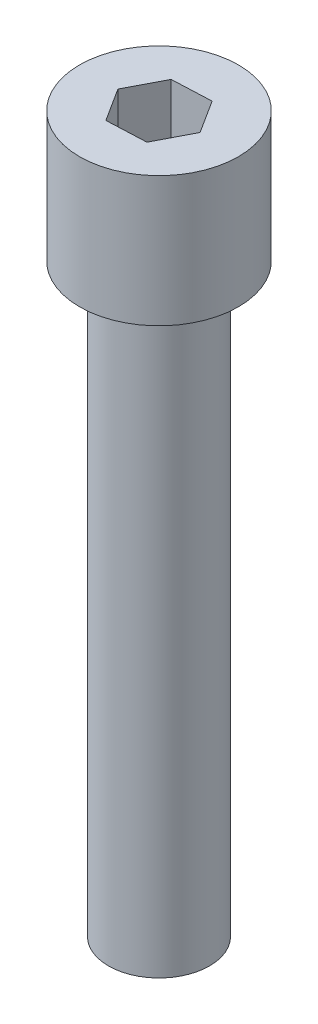
ISO-10303-21;
HEADER;
FILE_DESCRIPTION(('STEP AP214'),'2;1');
FILE_NAME('part.step','',(''),(''),'','','');
FILE_SCHEMA(('AUTOMOTIVE_DESIGN { 1 0 10303 214 1 1 1 1 }'));
ENDSEC;
DATA;
#1=APPLICATION_CONTEXT('core data for automotive mechanical design processes');
#2=APPLICATION_PROTOCOL_DEFINITION('international standard','automotive_design',2000,#1);
#3=PRODUCT_CONTEXT('',#1,'mechanical');
#4=PRODUCT('Part','Part','',(#3));
#5=PRODUCT_RELATED_PRODUCT_CATEGORY('part','',(#4));
#6=PRODUCT_DEFINITION_FORMATION('','',#4);
#7=PRODUCT_DEFINITION_CONTEXT('part definition',#1,'design');
#8=PRODUCT_DEFINITION('design','',#6,#7);
#9=PRODUCT_DEFINITION_SHAPE('','',#8);
#10=(LENGTH_UNIT() NAMED_UNIT(*) SI_UNIT(.MILLI.,.METRE.));
#11=(NAMED_UNIT(*) PLANE_ANGLE_UNIT() SI_UNIT($,.RADIAN.));
#12=(NAMED_UNIT(*) SI_UNIT($,.STERADIAN.) SOLID_ANGLE_UNIT());
#13=UNCERTAINTY_MEASURE_WITH_UNIT(LENGTH_MEASURE(1.E-05),#10,'distance_accuracy_value','');
#14=(GEOMETRIC_REPRESENTATION_CONTEXT(3) GLOBAL_UNCERTAINTY_ASSIGNED_CONTEXT((#13)) GLOBAL_UNIT_ASSIGNED_CONTEXT((#10,
#11,#12)) REPRESENTATION_CONTEXT('',''));
#15=CARTESIAN_POINT('',(0.,0.,0.));
#16=DIRECTION('',(0.,0.,1.));
#17=DIRECTION('',(1.,0.,0.));
#18=AXIS2_PLACEMENT_3D('',#15,#16,#17);
#19=CARTESIAN_POINT('',(0.,40.5,0.));
#20=DIRECTION('',(0.,-1.,0.));
#21=DIRECTION('',(0.,0.,-1.));
#22=AXIS2_PLACEMENT_3D('',#19,#20,#21);
#23=CYLINDRICAL_SURFACE('',#22,3.5);
#24=CARTESIAN_POINT('',(0.,40.5,0.));
#25=DIRECTION('',(0.,1.,0.));
#26=DIRECTION('',(0.,0.,1.));
#27=AXIS2_PLACEMENT_3D('',#24,#25,#26);
#28=CIRCLE('',#27,3.5);
#29=CARTESIAN_POINT('',(0.,40.5,3.5));
#30=VERTEX_POINT('',#29);
#31=EDGE_CURVE('E11',#30,#30,#28,.T.);
#32=ORIENTED_EDGE('',*,*,#31,.F.);
#33=EDGE_LOOP('',(#32));
#34=FACE_BOUND('',#33,.T.);
#35=CARTESIAN_POINT('',(0.,0.,0.));
#36=DIRECTION('',(0.,1.,0.));
#37=DIRECTION('',(0.,0.,1.));
#38=AXIS2_PLACEMENT_3D('',#35,#36,#37);
#39=CIRCLE('',#38,3.5);
#40=CARTESIAN_POINT('',(0.,0.,3.5));
#41=VERTEX_POINT('',#40);
#42=EDGE_CURVE('E42',#41,#41,#39,.T.);
#43=ORIENTED_EDGE('',*,*,#42,.T.);
#44=EDGE_LOOP('',(#43));
#45=FACE_BOUND('',#44,.T.);
#46=ADVANCED_FACE('F39',(#34,#45),#23,.T.);
#47=CARTESIAN_POINT('',(0.,0.,0.));
#48=DIRECTION('',(0.,1.,0.));
#49=DIRECTION('',(0.,0.,1.));
#50=AXIS2_PLACEMENT_3D('',#47,#48,#49);
#51=PLANE('',#50);
#52=ORIENTED_EDGE('',*,*,#42,.F.);
#53=EDGE_LOOP('',(#52));
#54=FACE_BOUND('',#53,.T.);
#55=ADVANCED_FACE('F176',(#54),#51,.F.);
#56=CARTESIAN_POINT('',(0.,40.5,0.));
#57=DIRECTION('',(0.,1.,0.));
#58=DIRECTION('',(0.,0.,1.));
#59=AXIS2_PLACEMENT_3D('',#56,#57,#58);
#60=PLANE('',#59);
#61=CARTESIAN_POINT('',(0.,40.5,0.));
#62=DIRECTION('',(0.,1.,0.));
#63=DIRECTION('',(0.,0.,1.));
#64=AXIS2_PLACEMENT_3D('',#61,#62,#63);
#65=CIRCLE('',#64,5.5);
#66=CARTESIAN_POINT('',(0.,40.5,5.5));
#67=VERTEX_POINT('',#66);
#68=EDGE_CURVE('E153',#67,#67,#65,.T.);
#69=ORIENTED_EDGE('',*,*,#68,.F.);
#70=EDGE_LOOP('',(#69));
#71=FACE_BOUND('',#70,.T.);
#72=ORIENTED_EDGE('',*,*,#31,.T.);
#73=EDGE_LOOP('',(#72));
#74=FACE_BOUND('',#73,.T.);
#75=ADVANCED_FACE('F173',(#71,#74),#60,.F.);
#76=CARTESIAN_POINT('',(0.,49.5,0.));
#77=DIRECTION('',(0.,-1.,0.));
#78=DIRECTION('',(0.,0.,-1.));
#79=AXIS2_PLACEMENT_3D('',#76,#77,#78);
#80=CYLINDRICAL_SURFACE('',#79,5.5);
#81=CARTESIAN_POINT('',(0.,49.5,0.));
#82=DIRECTION('',(0.,1.,0.));
#83=DIRECTION('',(0.,0.,1.));
#84=AXIS2_PLACEMENT_3D('',#81,#82,#83);
#85=CIRCLE('',#84,5.5);
#86=CARTESIAN_POINT('',(0.,49.5,5.5));
#87=VERTEX_POINT('',#86);
#88=EDGE_CURVE('E163',#87,#87,#85,.T.);
#89=ORIENTED_EDGE('',*,*,#88,.F.);
#90=EDGE_LOOP('',(#89));
#91=FACE_BOUND('',#90,.T.);
#92=ORIENTED_EDGE('',*,*,#68,.T.);
#93=EDGE_LOOP('',(#92));
#94=FACE_BOUND('',#93,.T.);
#95=ADVANCED_FACE('F171',(#91,#94),#80,.T.);
#96=CARTESIAN_POINT('',(0.,49.5,0.));
#97=DIRECTION('',(0.,1.,0.));
#98=DIRECTION('',(0.,0.,1.));
#99=AXIS2_PLACEMENT_3D('',#96,#97,#98);
#100=PLANE('',#99);
#101=DIRECTION('',(-0.537338075552758,0.,-0.843366938266647));
#102=VECTOR('',#101,1.);
#103=CARTESIAN_POINT('',(2.72322874019204,49.5,-0.119023180238171));
#104=LINE('',#103,#102);
#105=CARTESIAN_POINT('',(2.72322874019204,49.5,-0.119023180238171));
#106=VERTEX_POINT('',#105);
#107=CARTESIAN_POINT('',(1.25853727237055,49.5,-2.41789685944128));
#108=VERTEX_POINT('',#107);
#109=EDGE_CURVE('E54',#106,#108,#104,.T.);
#110=ORIENTED_EDGE('',*,*,#109,.F.);
#111=DIRECTION('',(0.461708155474439,0.,-0.887031892982654));
#112=VECTOR('',#111,1.);
#113=CARTESIAN_POINT('',(1.46469146782149,49.5,2.29887367920311));
#114=LINE('',#113,#112);
#115=CARTESIAN_POINT('',(1.46469146782149,49.5,2.29887367920311));
#116=VERTEX_POINT('',#115);
#117=EDGE_CURVE('E147',#116,#106,#114,.T.);
#118=ORIENTED_EDGE('',*,*,#117,.F.);
#119=DIRECTION('',(0.999046231027198,0.,-0.0436649547160069));
#120=VECTOR('',#119,1.);
#121=CARTESIAN_POINT('',(-1.25853727237055,49.5,2.41789685944128));
#122=LINE('',#121,#120);
#123=CARTESIAN_POINT('',(-1.25853727237055,49.5,2.41789685944128));
#124=VERTEX_POINT('',#123);
#125=EDGE_CURVE('E144',#124,#116,#122,.T.);
#126=ORIENTED_EDGE('',*,*,#125,.F.);
#127=DIRECTION('',(0.537338075552758,0.,0.843366938266647));
#128=VECTOR('',#127,1.);
#129=CARTESIAN_POINT('',(-2.72322874019204,49.5,0.119023180238171));
#130=LINE('',#129,#128);
#131=CARTESIAN_POINT('',(-2.72322874019204,49.5,0.119023180238171));
#132=VERTEX_POINT('',#131);
#133=EDGE_CURVE('E102',#132,#124,#130,.T.);
#134=ORIENTED_EDGE('',*,*,#133,.F.);
#135=DIRECTION('',(-0.461708155474439,0.,0.887031892982654));
#136=VECTOR('',#135,1.);
#137=CARTESIAN_POINT('',(-1.46469146782149,49.5,-2.29887367920311));
#138=LINE('',#137,#136);
#139=CARTESIAN_POINT('',(-1.46469146782149,49.5,-2.29887367920311));
#140=VERTEX_POINT('',#139);
#141=EDGE_CURVE('E138',#140,#132,#138,.T.);
#142=ORIENTED_EDGE('',*,*,#141,.F.);
#143=DIRECTION('',(-0.999046231027198,0.,0.0436649547160072));
#144=VECTOR('',#143,1.);
#145=CARTESIAN_POINT('',(1.25853727237055,49.5,-2.41789685944128));
#146=LINE('',#145,#144);
#147=EDGE_CURVE('E134',#108,#140,#146,.T.);
#148=ORIENTED_EDGE('',*,*,#147,.F.);
#149=EDGE_LOOP('',(#110,#118,#126,#134,#142,#148));
#150=FACE_BOUND('',#149,.T.);
#151=ORIENTED_EDGE('',*,*,#88,.T.);
#152=EDGE_LOOP('',(#151));
#153=FACE_BOUND('',#152,.T.);
#154=ADVANCED_FACE('F191',(#150,#153),#100,.T.);
#155=CARTESIAN_POINT('',(2.72322874019204,44.5,-0.119023180238171));
#156=DIRECTION('',(0.843366938266647,0.,-0.537338075552758));
#157=DIRECTION('',(-0.537338075552758,0.,-0.843366938266647));
#158=AXIS2_PLACEMENT_3D('',#155,#156,#157);
#159=PLANE('',#158);
#160=ORIENTED_EDGE('',*,*,#109,.T.);
#161=DIRECTION('',(0.,1.,0.));
#162=VECTOR('',#161,1.);
#163=CARTESIAN_POINT('',(1.25853727237055,44.5,-2.41789685944128));
#164=LINE('',#163,#162);
#165=CARTESIAN_POINT('',(1.25853727237055,44.5,-2.41789685944128));
#166=VERTEX_POINT('',#165);
#167=EDGE_CURVE('E84',#166,#108,#164,.T.);
#168=ORIENTED_EDGE('',*,*,#167,.F.);
#169=DIRECTION('',(-0.537338075552758,0.,-0.843366938266647));
#170=VECTOR('',#169,1.);
#171=CARTESIAN_POINT('',(2.72322874019204,44.5,-0.119023180238171));
#172=LINE('',#171,#170);
#173=CARTESIAN_POINT('',(2.72322874019204,44.5,-0.119023180238171));
#174=VERTEX_POINT('',#173);
#175=EDGE_CURVE('E150',#174,#166,#172,.T.);
#176=ORIENTED_EDGE('',*,*,#175,.F.);
#177=DIRECTION('',(0.,1.,0.));
#178=VECTOR('',#177,1.);
#179=CARTESIAN_POINT('',(2.72322874019204,44.5,-0.119023180238171));
#180=LINE('',#179,#178);
#181=EDGE_CURVE('E62',#174,#106,#180,.T.);
#182=ORIENTED_EDGE('',*,*,#181,.T.);
#183=EDGE_LOOP('',(#160,#168,#176,#182));
#184=FACE_BOUND('',#183,.T.);
#185=ADVANCED_FACE('F196',(#184),#159,.F.);
#186=CARTESIAN_POINT('',(1.46469146782149,44.5,2.29887367920311));
#187=DIRECTION('',(0.887031892982654,0.,0.461708155474439));
#188=DIRECTION('',(0.461708155474439,0.,-0.887031892982654));
#189=AXIS2_PLACEMENT_3D('',#186,#187,#188);
#190=PLANE('',#189);
#191=ORIENTED_EDGE('',*,*,#117,.T.);
#192=ORIENTED_EDGE('',*,*,#181,.F.);
#193=DIRECTION('',(0.461708155474439,0.,-0.887031892982654));
#194=VECTOR('',#193,1.);
#195=CARTESIAN_POINT('',(1.46469146782149,44.5,2.29887367920311));
#196=LINE('',#195,#194);
#197=CARTESIAN_POINT('',(1.46469146782149,44.5,2.29887367920311));
#198=VERTEX_POINT('',#197);
#199=EDGE_CURVE('E116',#198,#174,#196,.T.);
#200=ORIENTED_EDGE('',*,*,#199,.F.);
#201=DIRECTION('',(0.,1.,0.));
#202=VECTOR('',#201,1.);
#203=CARTESIAN_POINT('',(1.46469146782149,44.5,2.29887367920311));
#204=LINE('',#203,#202);
#205=EDGE_CURVE('E107',#198,#116,#204,.T.);
#206=ORIENTED_EDGE('',*,*,#205,.T.);
#207=EDGE_LOOP('',(#191,#192,#200,#206));
#208=FACE_BOUND('',#207,.T.);
#209=ADVANCED_FACE('F200',(#208),#190,.F.);
#210=CARTESIAN_POINT('',(-1.25853727237055,44.5,2.41789685944128));
#211=DIRECTION('',(0.0436649547160069,0.,0.999046231027198));
#212=DIRECTION('',(0.999046231027198,0.,-0.0436649547160069));
#213=AXIS2_PLACEMENT_3D('',#210,#211,#212);
#214=PLANE('',#213);
#215=ORIENTED_EDGE('',*,*,#125,.T.);
#216=ORIENTED_EDGE('',*,*,#205,.F.);
#217=DIRECTION('',(0.999046231027198,0.,-0.0436649547160069));
#218=VECTOR('',#217,1.);
#219=CARTESIAN_POINT('',(-1.25853727237055,44.5,2.41789685944128));
#220=LINE('',#219,#218);
#221=CARTESIAN_POINT('',(-1.25853727237055,44.5,2.41789685944128));
#222=VERTEX_POINT('',#221);
#223=EDGE_CURVE('E111',#222,#198,#220,.T.);
#224=ORIENTED_EDGE('',*,*,#223,.F.);
#225=DIRECTION('',(0.,1.,0.));
#226=VECTOR('',#225,1.);
#227=CARTESIAN_POINT('',(-1.25853727237055,44.5,2.41789685944128));
#228=LINE('',#227,#226);
#229=EDGE_CURVE('E95',#222,#124,#228,.T.);
#230=ORIENTED_EDGE('',*,*,#229,.T.);
#231=EDGE_LOOP('',(#215,#216,#224,#230));
#232=FACE_BOUND('',#231,.T.);
#233=ADVANCED_FACE('F112',(#232),#214,.F.);
#234=CARTESIAN_POINT('',(-2.72322874019204,44.5,0.119023180238171));
#235=DIRECTION('',(-0.843366938266647,0.,0.537338075552758));
#236=DIRECTION('',(0.537338075552758,0.,0.843366938266647));
#237=AXIS2_PLACEMENT_3D('',#234,#235,#236);
#238=PLANE('',#237);
#239=ORIENTED_EDGE('',*,*,#133,.T.);
#240=ORIENTED_EDGE('',*,*,#229,.F.);
#241=DIRECTION('',(0.537338075552758,0.,0.843366938266647));
#242=VECTOR('',#241,1.);
#243=CARTESIAN_POINT('',(-2.72322874019204,44.5,0.119023180238171));
#244=LINE('',#243,#242);
#245=CARTESIAN_POINT('',(-2.72322874019204,44.5,0.119023180238171));
#246=VERTEX_POINT('',#245);
#247=EDGE_CURVE('E99',#246,#222,#244,.T.);
#248=ORIENTED_EDGE('',*,*,#247,.F.);
#249=DIRECTION('',(0.,1.,0.));
#250=VECTOR('',#249,1.);
#251=CARTESIAN_POINT('',(-2.72322874019204,44.5,0.119023180238171));
#252=LINE('',#251,#250);
#253=EDGE_CURVE('E108',#246,#132,#252,.T.);
#254=ORIENTED_EDGE('',*,*,#253,.T.);
#255=EDGE_LOOP('',(#239,#240,#248,#254));
#256=FACE_BOUND('',#255,.T.);
#257=ADVANCED_FACE('F97',(#256),#238,.F.);
#258=CARTESIAN_POINT('',(-1.46469146782149,44.5,-2.29887367920311));
#259=DIRECTION('',(-0.887031892982654,0.,-0.461708155474439));
#260=DIRECTION('',(-0.461708155474439,0.,0.887031892982655));
#261=AXIS2_PLACEMENT_3D('',#258,#259,#260);
#262=PLANE('',#261);
#263=ORIENTED_EDGE('',*,*,#141,.T.);
#264=ORIENTED_EDGE('',*,*,#253,.F.);
#265=DIRECTION('',(-0.461708155474439,0.,0.887031892982654));
#266=VECTOR('',#265,1.);
#267=CARTESIAN_POINT('',(-1.46469146782149,44.5,-2.29887367920311));
#268=LINE('',#267,#266);
#269=CARTESIAN_POINT('',(-1.46469146782149,44.5,-2.29887367920311));
#270=VERTEX_POINT('',#269);
#271=EDGE_CURVE('E122',#270,#246,#268,.T.);
#272=ORIENTED_EDGE('',*,*,#271,.F.);
#273=DIRECTION('',(0.,1.,0.));
#274=VECTOR('',#273,1.);
#275=CARTESIAN_POINT('',(-1.46469146782149,44.5,-2.29887367920311));
#276=LINE('',#275,#274);
#277=EDGE_CURVE('E158',#270,#140,#276,.T.);
#278=ORIENTED_EDGE('',*,*,#277,.T.);
#279=EDGE_LOOP('',(#263,#264,#272,#278));
#280=FACE_BOUND('',#279,.T.);
#281=ADVANCED_FACE('F204',(#280),#262,.F.);
#282=CARTESIAN_POINT('',(1.25853727237055,44.5,-2.41789685944128));
#283=DIRECTION('',(-0.0436649547160072,0.,-0.999046231027198));
#284=DIRECTION('',(-0.999046231027198,0.,0.0436649547160072));
#285=AXIS2_PLACEMENT_3D('',#282,#283,#284);
#286=PLANE('',#285);
#287=ORIENTED_EDGE('',*,*,#147,.T.);
#288=ORIENTED_EDGE('',*,*,#277,.F.);
#289=DIRECTION('',(-0.999046231027198,0.,0.0436649547160072));
#290=VECTOR('',#289,1.);
#291=CARTESIAN_POINT('',(1.25853727237055,44.5,-2.41789685944128));
#292=LINE('',#291,#290);
#293=EDGE_CURVE('E126',#166,#270,#292,.T.);
#294=ORIENTED_EDGE('',*,*,#293,.F.);
#295=ORIENTED_EDGE('',*,*,#167,.T.);
#296=EDGE_LOOP('',(#287,#288,#294,#295));
#297=FACE_BOUND('',#296,.T.);
#298=ADVANCED_FACE('F201',(#297),#286,.F.);
#299=CARTESIAN_POINT('',(0.,44.5,0.));
#300=DIRECTION('',(0.,1.,0.));
#301=DIRECTION('',(0.,0.,1.));
#302=AXIS2_PLACEMENT_3D('',#299,#300,#301);
#303=PLANE('',#302);
#304=ORIENTED_EDGE('',*,*,#175,.T.);
#305=ORIENTED_EDGE('',*,*,#293,.T.);
#306=ORIENTED_EDGE('',*,*,#271,.T.);
#307=ORIENTED_EDGE('',*,*,#247,.T.);
#308=ORIENTED_EDGE('',*,*,#223,.T.);
#309=ORIENTED_EDGE('',*,*,#199,.T.);
#310=EDGE_LOOP('',(#304,#305,#306,#307,#308,#309));
#311=FACE_BOUND('',#310,.T.);
#312=ADVANCED_FACE('F119',(#311),#303,.T.);
#313=CLOSED_SHELL('',(#46,#55,#75,#95,#154,#185,#209,#233,#257,#281,#298,#312));
#314=MANIFOLD_SOLID_BREP('B2',#313);
#315=ADVANCED_BREP_SHAPE_REPRESENTATION('',(#18,#314),#14);
#316=SHAPE_DEFINITION_REPRESENTATION(#9,#315);
ENDSEC;
END-ISO-10303-21;
